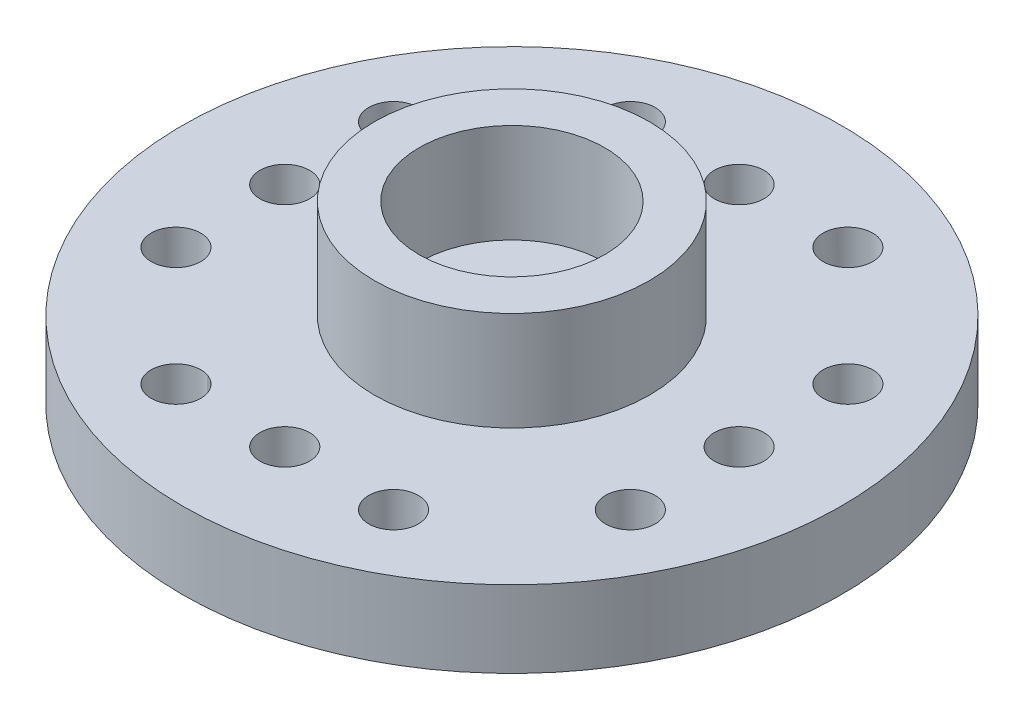
ISO-10303-21;
HEADER;
FILE_DESCRIPTION(('STEP AP214'),'2;1');
FILE_NAME('part.step','',(''),(''),'','','');
FILE_SCHEMA(('AUTOMOTIVE_DESIGN { 1 0 10303 214 1 1 1 1 }'));
ENDSEC;
DATA;
#1=APPLICATION_CONTEXT('core data for automotive mechanical design processes');
#2=APPLICATION_PROTOCOL_DEFINITION('international standard','automotive_design',2000,#1);
#3=PRODUCT_CONTEXT('',#1,'mechanical');
#4=PRODUCT('Part','Part','',(#3));
#5=PRODUCT_RELATED_PRODUCT_CATEGORY('part','',(#4));
#6=PRODUCT_DEFINITION_FORMATION('','',#4);
#7=PRODUCT_DEFINITION_CONTEXT('part definition',#1,'design');
#8=PRODUCT_DEFINITION('design','',#6,#7);
#9=PRODUCT_DEFINITION_SHAPE('','',#8);
#10=(LENGTH_UNIT() NAMED_UNIT(*) SI_UNIT(.MILLI.,.METRE.));
#11=(NAMED_UNIT(*) PLANE_ANGLE_UNIT() SI_UNIT($,.RADIAN.));
#12=(NAMED_UNIT(*) SI_UNIT($,.STERADIAN.) SOLID_ANGLE_UNIT());
#13=UNCERTAINTY_MEASURE_WITH_UNIT(LENGTH_MEASURE(1.E-05),#10,'distance_accuracy_value','');
#14=(GEOMETRIC_REPRESENTATION_CONTEXT(3) GLOBAL_UNCERTAINTY_ASSIGNED_CONTEXT((#13)) GLOBAL_UNIT_ASSIGNED_CONTEXT((#10,
#11,#12)) REPRESENTATION_CONTEXT('',''));
#15=CARTESIAN_POINT('',(0.,0.,0.));
#16=DIRECTION('',(0.,0.,1.));
#17=DIRECTION('',(1.,0.,0.));
#18=AXIS2_PLACEMENT_3D('',#15,#16,#17);
#19=CARTESIAN_POINT('',(0.,2.4,0.));
#20=DIRECTION('',(0.,1.,0.));
#21=DIRECTION('',(0.,0.,1.));
#22=AXIS2_PLACEMENT_3D('',#19,#20,#21);
#23=PLANE('',#22);
#24=CARTESIAN_POINT('',(7.1,2.4,-3.4));
#25=DIRECTION('',(0.,1.,0.));
#26=DIRECTION('',(0.,0.,1.));
#27=AXIS2_PLACEMENT_3D('',#24,#25,#26);
#28=CIRCLE('',#27,0.775000000000001);
#29=CARTESIAN_POINT('',(7.1,2.4,-2.625));
#30=VERTEX_POINT('',#29);
#31=EDGE_CURVE('E106',#30,#30,#28,.T.);
#32=ORIENTED_EDGE('',*,*,#31,.F.);
#33=EDGE_LOOP('',(#32));
#34=FACE_BOUND('',#33,.T.);
#35=CARTESIAN_POINT('',(0.,2.4,0.));
#36=DIRECTION('',(0.,1.,0.));
#37=DIRECTION('',(0.,0.,1.));
#38=AXIS2_PLACEMENT_3D('',#35,#36,#37);
#39=CIRCLE('',#38,7.1);
#40=CARTESIAN_POINT('',(-3.1237486958318,2.4,6.3759073146721));
#41=VERTEX_POINT('',#40);
#42=CARTESIAN_POINT('',(-3.00905548360986,2.4,6.43083082475021));
#43=VERTEX_POINT('',#42);
#44=EDGE_CURVE('E115',#41,#43,#39,.T.);
#45=ORIENTED_EDGE('',*,*,#44,.T.);
#46=CARTESIAN_POINT('',(-3.4,2.4,7.1));
#47=DIRECTION('',(0.,1.,0.));
#48=DIRECTION('',(0.,0.,1.));
#49=AXIS2_PLACEMENT_3D('',#46,#47,#48);
#50=CIRCLE('',#49,0.775);
#51=EDGE_CURVE('E126',#41,#43,#50,.T.);
#52=ORIENTED_EDGE('',*,*,#51,.F.);
#53=EDGE_LOOP('',(#45,#52));
#54=FACE_BOUND('',#53,.T.);
#55=CARTESIAN_POINT('',(7.1,2.4,0.));
#56=DIRECTION('',(0.,1.,0.));
#57=DIRECTION('',(0.,0.,1.));
#58=AXIS2_PLACEMENT_3D('',#55,#56,#57);
#59=CIRCLE('',#58,0.775);
#60=CARTESIAN_POINT('',(7.1,2.4,0.775));
#61=VERTEX_POINT('',#60);
#62=EDGE_CURVE('E135',#61,#61,#59,.F.);
#63=ORIENTED_EDGE('',*,*,#62,.T.);
#64=EDGE_LOOP('',(#63));
#65=FACE_BOUND('',#64,.T.);
#66=CARTESIAN_POINT('',(0.,2.4,-7.1));
#67=DIRECTION('',(0.,1.,0.));
#68=DIRECTION('',(0.,0.,1.));
#69=AXIS2_PLACEMENT_3D('',#66,#67,#68);
#70=CIRCLE('',#69,0.775);
#71=CARTESIAN_POINT('',(0.,2.4,-6.325));
#72=VERTEX_POINT('',#71);
#73=EDGE_CURVE('E154',#72,#72,#70,.F.);
#74=ORIENTED_EDGE('',*,*,#73,.T.);
#75=EDGE_LOOP('',(#74));
#76=FACE_BOUND('',#75,.T.);
#77=CARTESIAN_POINT('',(3.4,2.4,-7.1));
#78=DIRECTION('',(0.,1.,0.));
#79=DIRECTION('',(0.,0.,1.));
#80=AXIS2_PLACEMENT_3D('',#77,#78,#79);
#81=CIRCLE('',#80,0.775);
#82=CARTESIAN_POINT('',(3.4,2.4,-6.325));
#83=VERTEX_POINT('',#82);
#84=EDGE_CURVE('E153',#83,#83,#81,.F.);
#85=ORIENTED_EDGE('',*,*,#84,.T.);
#86=EDGE_LOOP('',(#85));
#87=FACE_BOUND('',#86,.T.);
#88=CARTESIAN_POINT('',(7.1,2.4,3.4));
#89=DIRECTION('',(0.,1.,0.));
#90=DIRECTION('',(0.,0.,1.));
#91=AXIS2_PLACEMENT_3D('',#88,#89,#90);
#92=CIRCLE('',#91,0.775000000000001);
#93=CARTESIAN_POINT('',(7.1,2.4,4.175));
#94=VERTEX_POINT('',#93);
#95=EDGE_CURVE('E166',#94,#94,#92,.F.);
#96=ORIENTED_EDGE('',*,*,#95,.T.);
#97=EDGE_LOOP('',(#96));
#98=FACE_BOUND('',#97,.T.);
#99=CARTESIAN_POINT('',(0.,2.4,7.1));
#100=DIRECTION('',(0.,1.,0.));
#101=DIRECTION('',(0.,0.,1.));
#102=AXIS2_PLACEMENT_3D('',#99,#100,#101);
#103=CIRCLE('',#102,0.775);
#104=CARTESIAN_POINT('',(0.,2.4,7.875));
#105=VERTEX_POINT('',#104);
#106=EDGE_CURVE('E136',#105,#105,#103,.F.);
#107=ORIENTED_EDGE('',*,*,#106,.T.);
#108=EDGE_LOOP('',(#107));
#109=FACE_BOUND('',#108,.T.);
#110=CARTESIAN_POINT('',(-7.1,2.4,0.));
#111=DIRECTION('',(0.,1.,0.));
#112=DIRECTION('',(0.,0.,1.));
#113=AXIS2_PLACEMENT_3D('',#110,#111,#112);
#114=CIRCLE('',#113,0.775000000000001);
#115=CARTESIAN_POINT('',(-7.1,2.4,0.775000000000001));
#116=VERTEX_POINT('',#115);
#117=EDGE_CURVE('E131',#116,#116,#114,.F.);
#118=ORIENTED_EDGE('',*,*,#117,.T.);
#119=EDGE_LOOP('',(#118));
#120=FACE_BOUND('',#119,.T.);
#121=CARTESIAN_POINT('',(0.,2.4,0.));
#122=DIRECTION('',(0.,1.,0.));
#123=DIRECTION('',(0.,0.,1.));
#124=AXIS2_PLACEMENT_3D('',#121,#122,#123);
#125=CIRCLE('',#124,4.3);
#126=CARTESIAN_POINT('',(0.,2.4,4.3));
#127=VERTEX_POINT('',#126);
#128=EDGE_CURVE('E182',#127,#127,#125,.T.);
#129=ORIENTED_EDGE('',*,*,#128,.F.);
#130=EDGE_LOOP('',(#129));
#131=FACE_BOUND('',#130,.T.);
#132=CARTESIAN_POINT('',(0.,2.4,0.));
#133=DIRECTION('',(0.,1.,0.));
#134=DIRECTION('',(0.,0.,1.));
#135=AXIS2_PLACEMENT_3D('',#132,#133,#134);
#136=CIRCLE('',#135,10.3);
#137=CARTESIAN_POINT('',(0.,2.4,10.3));
#138=VERTEX_POINT('',#137);
#139=EDGE_CURVE('E50',#138,#138,#136,.T.);
#140=ORIENTED_EDGE('',*,*,#139,.T.);
#141=EDGE_LOOP('',(#140));
#142=FACE_BOUND('',#141,.T.);
#143=CARTESIAN_POINT('',(3.4,2.4,7.1));
#144=DIRECTION('',(0.,1.,0.));
#145=DIRECTION('',(0.,0.,1.));
#146=AXIS2_PLACEMENT_3D('',#143,#144,#145);
#147=CIRCLE('',#146,0.775);
#148=CARTESIAN_POINT('',(3.4,2.4,7.875));
#149=VERTEX_POINT('',#148);
#150=EDGE_CURVE('E176',#149,#149,#147,.F.);
#151=ORIENTED_EDGE('',*,*,#150,.T.);
#152=EDGE_LOOP('',(#151));
#153=FACE_BOUND('',#152,.T.);
#154=CARTESIAN_POINT('',(-7.1,2.4,3.4));
#155=DIRECTION('',(0.,1.,0.));
#156=DIRECTION('',(0.,0.,1.));
#157=AXIS2_PLACEMENT_3D('',#154,#155,#156);
#158=CIRCLE('',#157,0.775);
#159=CARTESIAN_POINT('',(-7.1,2.4,4.175));
#160=VERTEX_POINT('',#159);
#161=EDGE_CURVE('E139',#160,#160,#158,.F.);
#162=ORIENTED_EDGE('',*,*,#161,.T.);
#163=EDGE_LOOP('',(#162));
#164=FACE_BOUND('',#163,.T.);
#165=CARTESIAN_POINT('',(-3.4,2.4,-7.1));
#166=DIRECTION('',(0.,1.,0.));
#167=DIRECTION('',(0.,0.,1.));
#168=AXIS2_PLACEMENT_3D('',#165,#166,#167);
#169=CIRCLE('',#168,0.775);
#170=CARTESIAN_POINT('',(-3.4,2.4,-6.325));
#171=VERTEX_POINT('',#170);
#172=EDGE_CURVE('E112',#171,#171,#169,.T.);
#173=ORIENTED_EDGE('',*,*,#172,.F.);
#174=EDGE_LOOP('',(#173));
#175=FACE_BOUND('',#174,.T.);
#176=CARTESIAN_POINT('',(0.,2.4,0.));
#177=DIRECTION('',(0.,1.,0.));
#178=DIRECTION('',(0.,0.,1.));
#179=AXIS2_PLACEMENT_3D('',#176,#177,#178);
#180=CIRCLE('',#179,7.1);
#181=CARTESIAN_POINT('',(-6.37590731467214,2.4,-3.12374869583171));
#182=VERTEX_POINT('',#181);
#183=CARTESIAN_POINT('',(-6.43083082475016,2.4,-3.00905548360996));
#184=VERTEX_POINT('',#183);
#185=EDGE_CURVE('E57',#182,#184,#180,.T.);
#186=ORIENTED_EDGE('',*,*,#185,.T.);
#187=CARTESIAN_POINT('',(-7.1,2.4,-3.4));
#188=DIRECTION('',(0.,1.,0.));
#189=DIRECTION('',(0.,0.,1.));
#190=AXIS2_PLACEMENT_3D('',#187,#188,#189);
#191=CIRCLE('',#190,0.775);
#192=EDGE_CURVE('E89',#182,#184,#191,.T.);
#193=ORIENTED_EDGE('',*,*,#192,.F.);
#194=EDGE_LOOP('',(#186,#193));
#195=FACE_BOUND('',#194,.T.);
#196=ADVANCED_FACE('F42',(#34,#54,#65,#76,#87,#98,#109,#120,#131,#142,#153,#164,#175,#195),#23,.T.);
#197=CARTESIAN_POINT('',(0.,0.,0.));
#198=DIRECTION('',(0.,1.,0.));
#199=DIRECTION('',(0.,0.,1.));
#200=AXIS2_PLACEMENT_3D('',#197,#198,#199);
#201=PLANE('',#200);
#202=CARTESIAN_POINT('',(0.,0.,0.));
#203=DIRECTION('',(0.,-1.,0.));
#204=DIRECTION('',(0.,0.,-1.));
#205=AXIS2_PLACEMENT_3D('',#202,#203,#204);
#206=CIRCLE('',#205,1.4);
#207=CARTESIAN_POINT('',(0.,0.,-1.4));
#208=VERTEX_POINT('',#207);
#209=EDGE_CURVE('E94',#208,#208,#206,.T.);
#210=ORIENTED_EDGE('',*,*,#209,.F.);
#211=EDGE_LOOP('',(#210));
#212=FACE_BOUND('',#211,.T.);
#213=CARTESIAN_POINT('',(3.4,0.,7.1));
#214=DIRECTION('',(0.,-1.,0.));
#215=DIRECTION('',(0.,0.,-1.));
#216=AXIS2_PLACEMENT_3D('',#213,#214,#215);
#217=CIRCLE('',#216,0.775);
#218=CARTESIAN_POINT('',(3.4,0.,6.325));
#219=VERTEX_POINT('',#218);
#220=EDGE_CURVE('E165',#219,#219,#217,.T.);
#221=ORIENTED_EDGE('',*,*,#220,.F.);
#222=EDGE_LOOP('',(#221));
#223=FACE_BOUND('',#222,.T.);
#224=CARTESIAN_POINT('',(7.1,0.,-3.4));
#225=DIRECTION('',(0.,1.,0.));
#226=DIRECTION('',(0.,0.,1.));
#227=AXIS2_PLACEMENT_3D('',#224,#225,#226);
#228=CIRCLE('',#227,0.775000000000001);
#229=CARTESIAN_POINT('',(7.1,0.,-2.625));
#230=VERTEX_POINT('',#229);
#231=EDGE_CURVE('E92',#230,#230,#228,.T.);
#232=ORIENTED_EDGE('',*,*,#231,.T.);
#233=EDGE_LOOP('',(#232));
#234=FACE_BOUND('',#233,.T.);
#235=CARTESIAN_POINT('',(-3.4,0.,-7.1));
#236=DIRECTION('',(0.,1.,0.));
#237=DIRECTION('',(0.,0.,-1.));
#238=AXIS2_PLACEMENT_3D('',#235,#236,#237);
#239=CIRCLE('',#238,0.775);
#240=CARTESIAN_POINT('',(-3.4,0.,-7.875));
#241=VERTEX_POINT('',#240);
#242=EDGE_CURVE('E109',#241,#241,#239,.T.);
#243=ORIENTED_EDGE('',*,*,#242,.T.);
#244=EDGE_LOOP('',(#243));
#245=FACE_BOUND('',#244,.T.);
#246=CARTESIAN_POINT('',(-7.1,0.,3.4));
#247=DIRECTION('',(0.,-1.,0.));
#248=DIRECTION('',(0.,0.,-1.));
#249=AXIS2_PLACEMENT_3D('',#246,#247,#248);
#250=CIRCLE('',#249,0.775);
#251=CARTESIAN_POINT('',(-7.1,0.,2.625));
#252=VERTEX_POINT('',#251);
#253=EDGE_CURVE('E140',#252,#252,#250,.T.);
#254=ORIENTED_EDGE('',*,*,#253,.F.);
#255=EDGE_LOOP('',(#254));
#256=FACE_BOUND('',#255,.T.);
#257=CARTESIAN_POINT('',(7.1,0.,0.));
#258=DIRECTION('',(0.,-1.,0.));
#259=DIRECTION('',(0.,0.,-1.));
#260=AXIS2_PLACEMENT_3D('',#257,#258,#259);
#261=CIRCLE('',#260,0.775);
#262=CARTESIAN_POINT('',(7.1,0.,-0.775));
#263=VERTEX_POINT('',#262);
#264=EDGE_CURVE('E157',#263,#263,#261,.T.);
#265=ORIENTED_EDGE('',*,*,#264,.F.);
#266=EDGE_LOOP('',(#265));
#267=FACE_BOUND('',#266,.T.);
#268=CARTESIAN_POINT('',(0.,0.,-7.1));
#269=DIRECTION('',(0.,-1.,0.));
#270=DIRECTION('',(0.,0.,-1.));
#271=AXIS2_PLACEMENT_3D('',#268,#269,#270);
#272=CIRCLE('',#271,0.775);
#273=CARTESIAN_POINT('',(0.,0.,-7.875));
#274=VERTEX_POINT('',#273);
#275=EDGE_CURVE('E150',#274,#274,#272,.T.);
#276=ORIENTED_EDGE('',*,*,#275,.F.);
#277=EDGE_LOOP('',(#276));
#278=FACE_BOUND('',#277,.T.);
#279=CARTESIAN_POINT('',(3.4,0.,-7.1));
#280=DIRECTION('',(0.,-1.,0.));
#281=DIRECTION('',(0.,0.,-1.));
#282=AXIS2_PLACEMENT_3D('',#279,#280,#281);
#283=CIRCLE('',#282,0.775);
#284=CARTESIAN_POINT('',(3.4,0.,-7.875));
#285=VERTEX_POINT('',#284);
#286=EDGE_CURVE('E169',#285,#285,#283,.T.);
#287=ORIENTED_EDGE('',*,*,#286,.F.);
#288=EDGE_LOOP('',(#287));
#289=FACE_BOUND('',#288,.T.);
#290=CARTESIAN_POINT('',(7.1,0.,3.4));
#291=DIRECTION('',(0.,-1.,0.));
#292=DIRECTION('',(0.,0.,-1.));
#293=AXIS2_PLACEMENT_3D('',#290,#291,#292);
#294=CIRCLE('',#293,0.775000000000001);
#295=CARTESIAN_POINT('',(7.1,0.,2.625));
#296=VERTEX_POINT('',#295);
#297=EDGE_CURVE('E162',#296,#296,#294,.T.);
#298=ORIENTED_EDGE('',*,*,#297,.F.);
#299=EDGE_LOOP('',(#298));
#300=FACE_BOUND('',#299,.T.);
#301=CARTESIAN_POINT('',(0.,0.,7.1));
#302=DIRECTION('',(0.,-1.,0.));
#303=DIRECTION('',(0.,0.,-1.));
#304=AXIS2_PLACEMENT_3D('',#301,#302,#303);
#305=CIRCLE('',#304,0.775);
#306=CARTESIAN_POINT('',(0.,0.,6.325));
#307=VERTEX_POINT('',#306);
#308=EDGE_CURVE('E132',#307,#307,#305,.T.);
#309=ORIENTED_EDGE('',*,*,#308,.F.);
#310=EDGE_LOOP('',(#309));
#311=FACE_BOUND('',#310,.T.);
#312=CARTESIAN_POINT('',(0.,0.,0.));
#313=DIRECTION('',(0.,1.,0.));
#314=DIRECTION('',(0.,0.,1.));
#315=AXIS2_PLACEMENT_3D('',#312,#313,#314);
#316=CIRCLE('',#315,10.3);
#317=CARTESIAN_POINT('',(0.,0.,10.3));
#318=VERTEX_POINT('',#317);
#319=EDGE_CURVE('E186',#318,#318,#316,.T.);
#320=ORIENTED_EDGE('',*,*,#319,.F.);
#321=EDGE_LOOP('',(#320));
#322=FACE_BOUND('',#321,.T.);
#323=CARTESIAN_POINT('',(-7.1,0.,0.));
#324=DIRECTION('',(0.,-1.,0.));
#325=DIRECTION('',(0.,0.,-1.));
#326=AXIS2_PLACEMENT_3D('',#323,#324,#325);
#327=CIRCLE('',#326,0.775000000000001);
#328=CARTESIAN_POINT('',(-7.1,0.,-0.775000000000001));
#329=VERTEX_POINT('',#328);
#330=EDGE_CURVE('E143',#329,#329,#327,.T.);
#331=ORIENTED_EDGE('',*,*,#330,.F.);
#332=EDGE_LOOP('',(#331));
#333=FACE_BOUND('',#332,.T.);
#334=CARTESIAN_POINT('',(-3.4,0.,7.1));
#335=DIRECTION('',(0.,1.,0.));
#336=DIRECTION('',(0.,0.,-1.));
#337=AXIS2_PLACEMENT_3D('',#334,#335,#336);
#338=CIRCLE('',#337,0.775);
#339=CARTESIAN_POINT('',(-3.1237486958318,0.,6.37590731467209));
#340=VERTEX_POINT('',#339);
#341=CARTESIAN_POINT('',(-3.00905548360986,0.,6.43083082475021));
#342=VERTEX_POINT('',#341);
#343=EDGE_CURVE('E120',#340,#342,#338,.T.);
#344=ORIENTED_EDGE('',*,*,#343,.T.);
#345=CARTESIAN_POINT('',(0.,0.,0.));
#346=DIRECTION('',(0.,1.,0.));
#347=DIRECTION('',(0.,0.,-1.));
#348=AXIS2_PLACEMENT_3D('',#345,#346,#347);
#349=CIRCLE('',#348,7.1);
#350=EDGE_CURVE('E118',#340,#342,#349,.T.);
#351=ORIENTED_EDGE('',*,*,#350,.F.);
#352=EDGE_LOOP('',(#344,#351));
#353=FACE_BOUND('',#352,.T.);
#354=CARTESIAN_POINT('',(-7.1,0.,-3.4));
#355=DIRECTION('',(0.,1.,0.));
#356=DIRECTION('',(0.,0.,1.));
#357=AXIS2_PLACEMENT_3D('',#354,#355,#356);
#358=CIRCLE('',#357,0.775);
#359=CARTESIAN_POINT('',(-6.37590731467214,0.,-3.12374869583171));
#360=VERTEX_POINT('',#359);
#361=CARTESIAN_POINT('',(-6.43083082475016,0.,-3.00905548360996));
#362=VERTEX_POINT('',#361);
#363=EDGE_CURVE('E86',#360,#362,#358,.T.);
#364=ORIENTED_EDGE('',*,*,#363,.T.);
#365=CARTESIAN_POINT('',(0.,0.,0.));
#366=DIRECTION('',(0.,1.,0.));
#367=DIRECTION('',(0.,0.,1.));
#368=AXIS2_PLACEMENT_3D('',#365,#366,#367);
#369=CIRCLE('',#368,7.1);
#370=EDGE_CURVE('E62',#360,#362,#369,.T.);
#371=ORIENTED_EDGE('',*,*,#370,.F.);
#372=EDGE_LOOP('',(#364,#371));
#373=FACE_BOUND('',#372,.T.);
#374=ADVANCED_FACE('F194',(#212,#223,#234,#245,#256,#267,#278,#289,#300,#311,#322,#333,#353,
#373),#201,.F.);
#375=CARTESIAN_POINT('',(0.,2.4,0.));
#376=DIRECTION('',(0.,-1.,0.));
#377=DIRECTION('',(0.,0.,-1.));
#378=AXIS2_PLACEMENT_3D('',#375,#376,#377);
#379=CYLINDRICAL_SURFACE('',#378,10.3);
#380=ORIENTED_EDGE('',*,*,#139,.F.);
#381=EDGE_LOOP('',(#380));
#382=FACE_BOUND('',#381,.T.);
#383=ORIENTED_EDGE('',*,*,#319,.T.);
#384=EDGE_LOOP('',(#383));
#385=FACE_BOUND('',#384,.T.);
#386=ADVANCED_FACE('F44',(#382,#385),#379,.T.);
#387=CARTESIAN_POINT('',(0.,5.5,0.));
#388=DIRECTION('',(0.,1.,0.));
#389=DIRECTION('',(0.,0.,1.));
#390=AXIS2_PLACEMENT_3D('',#387,#388,#389);
#391=PLANE('',#390);
#392=CARTESIAN_POINT('',(0.,5.5,0.));
#393=DIRECTION('',(0.,1.,0.));
#394=DIRECTION('',(0.,0.,1.));
#395=AXIS2_PLACEMENT_3D('',#392,#393,#394);
#396=CIRCLE('',#395,4.3);
#397=CARTESIAN_POINT('',(0.,5.5,4.3));
#398=VERTEX_POINT('',#397);
#399=EDGE_CURVE('E183',#398,#398,#396,.T.);
#400=ORIENTED_EDGE('',*,*,#399,.T.);
#401=EDGE_LOOP('',(#400));
#402=FACE_BOUND('',#401,.T.);
#403=CARTESIAN_POINT('',(0.,5.5,0.));
#404=DIRECTION('',(0.,1.,0.));
#405=DIRECTION('',(0.,0.,1.));
#406=AXIS2_PLACEMENT_3D('',#403,#404,#405);
#407=CIRCLE('',#406,2.9);
#408=CARTESIAN_POINT('',(0.,5.5,2.9));
#409=VERTEX_POINT('',#408);
#410=EDGE_CURVE('E179',#409,#409,#407,.T.);
#411=ORIENTED_EDGE('',*,*,#410,.F.);
#412=EDGE_LOOP('',(#411));
#413=FACE_BOUND('',#412,.T.);
#414=ADVANCED_FACE('F298',(#402,#413),#391,.T.);
#415=CARTESIAN_POINT('',(0.,5.5,0.));
#416=DIRECTION('',(0.,-1.,0.));
#417=DIRECTION('',(0.,0.,-1.));
#418=AXIS2_PLACEMENT_3D('',#415,#416,#417);
#419=CYLINDRICAL_SURFACE('',#418,4.3);
#420=ORIENTED_EDGE('',*,*,#399,.F.);
#421=EDGE_LOOP('',(#420));
#422=FACE_BOUND('',#421,.T.);
#423=ORIENTED_EDGE('',*,*,#128,.T.);
#424=EDGE_LOOP('',(#423));
#425=FACE_BOUND('',#424,.T.);
#426=ADVANCED_FACE('F296',(#422,#425),#419,.T.);
#427=CARTESIAN_POINT('',(0.,5.5,0.));
#428=DIRECTION('',(0.,-1.,0.));
#429=DIRECTION('',(0.,0.,-1.));
#430=AXIS2_PLACEMENT_3D('',#427,#428,#429);
#431=CYLINDRICAL_SURFACE('',#430,2.9);
#432=ORIENTED_EDGE('',*,*,#410,.T.);
#433=EDGE_LOOP('',(#432));
#434=FACE_BOUND('',#433,.T.);
#435=CARTESIAN_POINT('',(0.,2.4,0.));
#436=DIRECTION('',(0.,1.,0.));
#437=DIRECTION('',(0.,0.,1.));
#438=AXIS2_PLACEMENT_3D('',#435,#436,#437);
#439=CIRCLE('',#438,2.9);
#440=CARTESIAN_POINT('',(0.,2.4,2.9));
#441=VERTEX_POINT('',#440);
#442=EDGE_CURVE('E12',#441,#441,#439,.F.);
#443=ORIENTED_EDGE('',*,*,#442,.T.);
#444=EDGE_LOOP('',(#443));
#445=FACE_BOUND('',#444,.T.);
#446=ADVANCED_FACE('F293',(#434,#445),#431,.F.);
#447=CARTESIAN_POINT('',(0.,2.4,0.));
#448=DIRECTION('',(0.,1.,0.));
#449=DIRECTION('',(0.,0.,1.));
#450=AXIS2_PLACEMENT_3D('',#447,#448,#449);
#451=CIRCLE('',#450,1.4);
#452=CARTESIAN_POINT('',(0.,2.4,1.4));
#453=VERTEX_POINT('',#452);
#454=EDGE_CURVE('E98',#453,#453,#451,.F.);
#455=ORIENTED_EDGE('',*,*,#454,.T.);
#456=EDGE_LOOP('',(#455));
#457=FACE_BOUND('',#456,.T.);
#458=ORIENTED_EDGE('',*,*,#442,.F.);
#459=EDGE_LOOP('',(#458));
#460=FACE_BOUND('',#459,.T.);
#461=ADVANCED_FACE('F214',(#457,#460),#23,.T.);
#462=CARTESIAN_POINT('',(3.4,5.501,7.1));
#463=DIRECTION('',(0.,-1.,0.));
#464=DIRECTION('',(0.,0.,-1.));
#465=AXIS2_PLACEMENT_3D('',#462,#463,#464);
#466=CYLINDRICAL_SURFACE('',#465,0.775);
#467=ORIENTED_EDGE('',*,*,#220,.T.);
#468=EDGE_LOOP('',(#467));
#469=FACE_BOUND('',#468,.T.);
#470=ORIENTED_EDGE('',*,*,#150,.F.);
#471=EDGE_LOOP('',(#470));
#472=FACE_BOUND('',#471,.T.);
#473=ADVANCED_FACE('F277',(#469,#472),#466,.F.);
#474=CARTESIAN_POINT('',(-7.1,5.501,0.));
#475=DIRECTION('',(0.,-1.,0.));
#476=DIRECTION('',(0.,0.,-1.));
#477=AXIS2_PLACEMENT_3D('',#474,#475,#476);
#478=CYLINDRICAL_SURFACE('',#477,0.775000000000001);
#479=ORIENTED_EDGE('',*,*,#117,.F.);
#480=EDGE_LOOP('',(#479));
#481=FACE_BOUND('',#480,.T.);
#482=ORIENTED_EDGE('',*,*,#330,.T.);
#483=EDGE_LOOP('',(#482));
#484=FACE_BOUND('',#483,.T.);
#485=ADVANCED_FACE('F269',(#481,#484),#478,.F.);
#486=CARTESIAN_POINT('',(-7.1,5.501,3.4));
#487=DIRECTION('',(0.,-1.,0.));
#488=DIRECTION('',(0.,0.,-1.));
#489=AXIS2_PLACEMENT_3D('',#486,#487,#488);
#490=CYLINDRICAL_SURFACE('',#489,0.775);
#491=ORIENTED_EDGE('',*,*,#253,.T.);
#492=EDGE_LOOP('',(#491));
#493=FACE_BOUND('',#492,.T.);
#494=ORIENTED_EDGE('',*,*,#161,.F.);
#495=EDGE_LOOP('',(#494));
#496=FACE_BOUND('',#495,.T.);
#497=ADVANCED_FACE('F259',(#493,#496),#490,.F.);
#498=CARTESIAN_POINT('',(0.,5.501,7.1));
#499=DIRECTION('',(0.,-1.,0.));
#500=DIRECTION('',(0.,0.,-1.));
#501=AXIS2_PLACEMENT_3D('',#498,#499,#500);
#502=CYLINDRICAL_SURFACE('',#501,0.775);
#503=ORIENTED_EDGE('',*,*,#106,.F.);
#504=EDGE_LOOP('',(#503));
#505=FACE_BOUND('',#504,.T.);
#506=ORIENTED_EDGE('',*,*,#308,.T.);
#507=EDGE_LOOP('',(#506));
#508=FACE_BOUND('',#507,.T.);
#509=ADVANCED_FACE('F256',(#505,#508),#502,.F.);
#510=CARTESIAN_POINT('',(7.1,5.501,3.4));
#511=DIRECTION('',(0.,-1.,0.));
#512=DIRECTION('',(0.,0.,-1.));
#513=AXIS2_PLACEMENT_3D('',#510,#511,#512);
#514=CYLINDRICAL_SURFACE('',#513,0.775000000000001);
#515=ORIENTED_EDGE('',*,*,#95,.F.);
#516=EDGE_LOOP('',(#515));
#517=FACE_BOUND('',#516,.T.);
#518=ORIENTED_EDGE('',*,*,#297,.T.);
#519=EDGE_LOOP('',(#518));
#520=FACE_BOUND('',#519,.T.);
#521=ADVANCED_FACE('F258',(#517,#520),#514,.F.);
#522=CARTESIAN_POINT('',(3.4,5.501,-7.1));
#523=DIRECTION('',(0.,-1.,0.));
#524=DIRECTION('',(0.,0.,-1.));
#525=AXIS2_PLACEMENT_3D('',#522,#523,#524);
#526=CYLINDRICAL_SURFACE('',#525,0.775);
#527=ORIENTED_EDGE('',*,*,#84,.F.);
#528=EDGE_LOOP('',(#527));
#529=FACE_BOUND('',#528,.T.);
#530=ORIENTED_EDGE('',*,*,#286,.T.);
#531=EDGE_LOOP('',(#530));
#532=FACE_BOUND('',#531,.T.);
#533=ADVANCED_FACE('F266',(#529,#532),#526,.F.);
#534=CARTESIAN_POINT('',(0.,5.501,-7.1));
#535=DIRECTION('',(0.,-1.,0.));
#536=DIRECTION('',(0.,0.,-1.));
#537=AXIS2_PLACEMENT_3D('',#534,#535,#536);
#538=CYLINDRICAL_SURFACE('',#537,0.775);
#539=ORIENTED_EDGE('',*,*,#73,.F.);
#540=EDGE_LOOP('',(#539));
#541=FACE_BOUND('',#540,.T.);
#542=ORIENTED_EDGE('',*,*,#275,.T.);
#543=EDGE_LOOP('',(#542));
#544=FACE_BOUND('',#543,.T.);
#545=ADVANCED_FACE('F279',(#541,#544),#538,.F.);
#546=CARTESIAN_POINT('',(7.1,5.501,0.));
#547=DIRECTION('',(0.,-1.,0.));
#548=DIRECTION('',(0.,0.,-1.));
#549=AXIS2_PLACEMENT_3D('',#546,#547,#548);
#550=CYLINDRICAL_SURFACE('',#549,0.775);
#551=ORIENTED_EDGE('',*,*,#62,.F.);
#552=EDGE_LOOP('',(#551));
#553=FACE_BOUND('',#552,.T.);
#554=ORIENTED_EDGE('',*,*,#264,.T.);
#555=EDGE_LOOP('',(#554));
#556=FACE_BOUND('',#555,.T.);
#557=ADVANCED_FACE('F282',(#553,#556),#550,.F.);
#558=CARTESIAN_POINT('',(0.,5.501,0.));
#559=DIRECTION('',(0.,-1.,0.));
#560=DIRECTION('',(0.,0.,-1.));
#561=AXIS2_PLACEMENT_3D('',#558,#559,#560);
#562=CYLINDRICAL_SURFACE('',#561,7.1);
#563=DIRECTION('',(0.,-1.,0.));
#564=VECTOR('',#563,1.);
#565=CARTESIAN_POINT('',(-3.1237486958318,5.501,6.37590731467209));
#566=LINE('',#565,#564);
#567=EDGE_CURVE('E124',#41,#340,#566,.T.);
#568=ORIENTED_EDGE('',*,*,#567,.T.);
#569=ORIENTED_EDGE('',*,*,#350,.T.);
#570=DIRECTION('',(0.,-1.,0.));
#571=VECTOR('',#570,1.);
#572=CARTESIAN_POINT('',(-3.00905548360986,5.501,6.43083082475021));
#573=LINE('',#572,#571);
#574=EDGE_CURVE('E123',#43,#342,#573,.T.);
#575=ORIENTED_EDGE('',*,*,#574,.F.);
#576=ORIENTED_EDGE('',*,*,#44,.F.);
#577=EDGE_LOOP('',(#568,#569,#575,#576));
#578=FACE_BOUND('',#577,.T.);
#579=ADVANCED_FACE('F208',(#578),#562,.T.);
#580=CARTESIAN_POINT('',(-3.4,5.501,7.1));
#581=DIRECTION('',(0.,-1.,0.));
#582=DIRECTION('',(0.,0.,-1.));
#583=AXIS2_PLACEMENT_3D('',#580,#581,#582);
#584=CYLINDRICAL_SURFACE('',#583,0.775);
#585=ORIENTED_EDGE('',*,*,#51,.T.);
#586=ORIENTED_EDGE('',*,*,#574,.T.);
#587=ORIENTED_EDGE('',*,*,#343,.F.);
#588=ORIENTED_EDGE('',*,*,#567,.F.);
#589=EDGE_LOOP('',(#585,#586,#587,#588));
#590=FACE_BOUND('',#589,.T.);
#591=ADVANCED_FACE('F205',(#590),#584,.F.);
#592=CARTESIAN_POINT('',(-3.4,5.501,-7.1));
#593=DIRECTION('',(0.,-1.,0.));
#594=DIRECTION('',(0.,0.,-1.));
#595=AXIS2_PLACEMENT_3D('',#592,#593,#594);
#596=CYLINDRICAL_SURFACE('',#595,0.775);
#597=ORIENTED_EDGE('',*,*,#172,.T.);
#598=EDGE_LOOP('',(#597));
#599=FACE_BOUND('',#598,.T.);
#600=ORIENTED_EDGE('',*,*,#242,.F.);
#601=EDGE_LOOP('',(#600));
#602=FACE_BOUND('',#601,.T.);
#603=ADVANCED_FACE('F237',(#599,#602),#596,.F.);
#604=CARTESIAN_POINT('',(0.,5.501,0.));
#605=DIRECTION('',(0.,-1.,0.));
#606=DIRECTION('',(0.,0.,-1.));
#607=AXIS2_PLACEMENT_3D('',#604,#605,#606);
#608=CYLINDRICAL_SURFACE('',#607,7.1);
#609=DIRECTION('',(0.,-1.,0.));
#610=VECTOR('',#609,1.);
#611=CARTESIAN_POINT('',(-6.37590731467214,5.501,-3.12374869583171));
#612=LINE('',#611,#610);
#613=EDGE_CURVE('E85',#182,#360,#612,.T.);
#614=ORIENTED_EDGE('',*,*,#613,.T.);
#615=ORIENTED_EDGE('',*,*,#370,.T.);
#616=DIRECTION('',(0.,-1.,0.));
#617=VECTOR('',#616,1.);
#618=CARTESIAN_POINT('',(-6.43083082475016,5.501,-3.00905548360996));
#619=LINE('',#618,#617);
#620=EDGE_CURVE('E79',#184,#362,#619,.T.);
#621=ORIENTED_EDGE('',*,*,#620,.F.);
#622=ORIENTED_EDGE('',*,*,#185,.F.);
#623=EDGE_LOOP('',(#614,#615,#621,#622));
#624=FACE_BOUND('',#623,.T.);
#625=ADVANCED_FACE('F81',(#624),#608,.T.);
#626=CARTESIAN_POINT('',(-7.1,5.501,-3.4));
#627=DIRECTION('',(0.,-1.,0.));
#628=DIRECTION('',(0.,0.,-1.));
#629=AXIS2_PLACEMENT_3D('',#626,#627,#628);
#630=CYLINDRICAL_SURFACE('',#629,0.775);
#631=ORIENTED_EDGE('',*,*,#192,.T.);
#632=ORIENTED_EDGE('',*,*,#620,.T.);
#633=ORIENTED_EDGE('',*,*,#363,.F.);
#634=ORIENTED_EDGE('',*,*,#613,.F.);
#635=EDGE_LOOP('',(#631,#632,#633,#634));
#636=FACE_BOUND('',#635,.T.);
#637=ADVANCED_FACE('F90',(#636),#630,.F.);
#638=CARTESIAN_POINT('',(7.1,5.501,-3.4));
#639=DIRECTION('',(0.,-1.,0.));
#640=DIRECTION('',(0.,0.,-1.));
#641=AXIS2_PLACEMENT_3D('',#638,#639,#640);
#642=CYLINDRICAL_SURFACE('',#641,0.775000000000001);
#643=ORIENTED_EDGE('',*,*,#31,.T.);
#644=EDGE_LOOP('',(#643));
#645=FACE_BOUND('',#644,.T.);
#646=ORIENTED_EDGE('',*,*,#231,.F.);
#647=EDGE_LOOP('',(#646));
#648=FACE_BOUND('',#647,.T.);
#649=ADVANCED_FACE('F323',(#645,#648),#642,.F.);
#650=CARTESIAN_POINT('',(0.,5.501,0.));
#651=DIRECTION('',(0.,-1.,0.));
#652=DIRECTION('',(0.,0.,-1.));
#653=AXIS2_PLACEMENT_3D('',#650,#651,#652);
#654=CYLINDRICAL_SURFACE('',#653,1.4);
#655=ORIENTED_EDGE('',*,*,#454,.F.);
#656=EDGE_LOOP('',(#655));
#657=FACE_BOUND('',#656,.T.);
#658=ORIENTED_EDGE('',*,*,#209,.T.);
#659=EDGE_LOOP('',(#658));
#660=FACE_BOUND('',#659,.T.);
#661=ADVANCED_FACE('F320',(#657,#660),#654,.F.);
#662=CLOSED_SHELL('',(#196,#374,#386,#414,#426,#446,#461,#473,#485,#497,#509,#521,#533,#545,
#557,#579,#591,#603,#625,#637,#649,#661));
#663=MANIFOLD_SOLID_BREP('B2',#662);
#664=ADVANCED_BREP_SHAPE_REPRESENTATION('',(#18,#663),#14);
#665=SHAPE_DEFINITION_REPRESENTATION(#9,#664);
ENDSEC;
END-ISO-10303-21;
